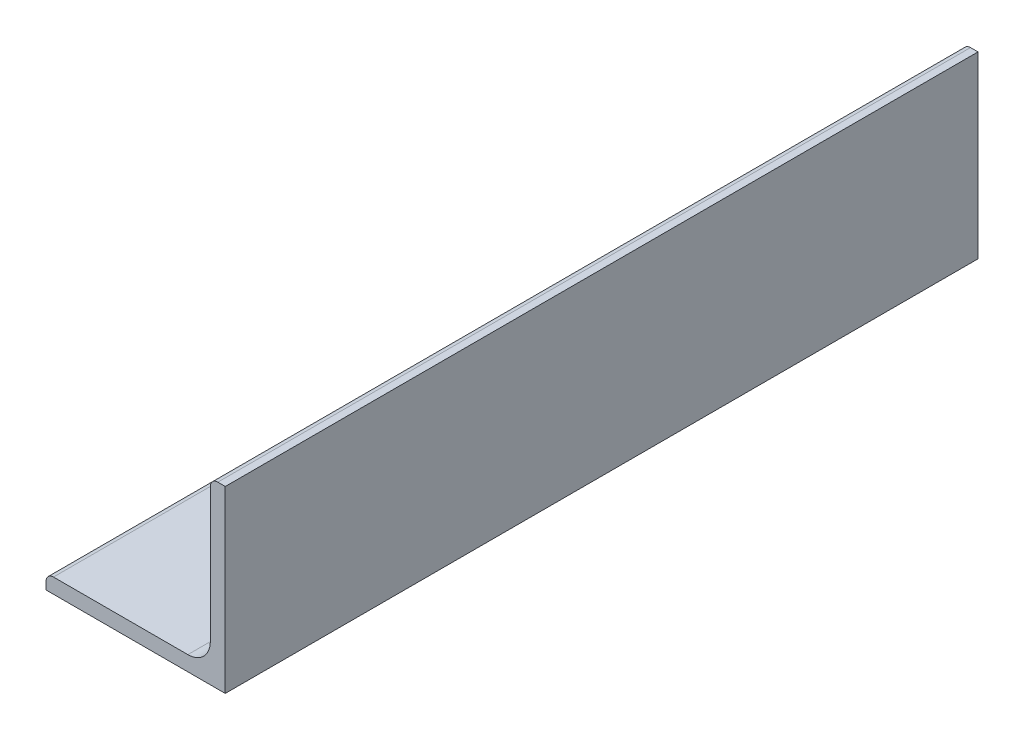
ISO-10303-21;
HEADER;
FILE_DESCRIPTION(('STEP AP214'),'2;1');
FILE_NAME('part.step','',(''),(''),'','','');
FILE_SCHEMA(('AUTOMOTIVE_DESIGN { 1 0 10303 214 1 1 1 1 }'));
ENDSEC;
DATA;
#1=APPLICATION_CONTEXT('core data for automotive mechanical design processes');
#2=APPLICATION_PROTOCOL_DEFINITION('international standard','automotive_design',2000,#1);
#3=PRODUCT_CONTEXT('',#1,'mechanical');
#4=PRODUCT('Part','Part','',(#3));
#5=PRODUCT_RELATED_PRODUCT_CATEGORY('part','',(#4));
#6=PRODUCT_DEFINITION_FORMATION('','',#4);
#7=PRODUCT_DEFINITION_CONTEXT('part definition',#1,'design');
#8=PRODUCT_DEFINITION('design','',#6,#7);
#9=PRODUCT_DEFINITION_SHAPE('','',#8);
#10=(LENGTH_UNIT() NAMED_UNIT(*) SI_UNIT(.MILLI.,.METRE.));
#11=(NAMED_UNIT(*) PLANE_ANGLE_UNIT() SI_UNIT($,.RADIAN.));
#12=(NAMED_UNIT(*) SI_UNIT($,.STERADIAN.) SOLID_ANGLE_UNIT());
#13=UNCERTAINTY_MEASURE_WITH_UNIT(LENGTH_MEASURE(1.E-05),#10,'distance_accuracy_value','');
#14=(GEOMETRIC_REPRESENTATION_CONTEXT(3) GLOBAL_UNCERTAINTY_ASSIGNED_CONTEXT((#13)) GLOBAL_UNIT_ASSIGNED_CONTEXT((#10,
#11,#12)) REPRESENTATION_CONTEXT('',''));
#15=CARTESIAN_POINT('',(0.,0.,0.));
#16=DIRECTION('',(0.,0.,1.));
#17=DIRECTION('',(1.,0.,0.));
#18=AXIS2_PLACEMENT_3D('',#15,#16,#17);
#19=CARTESIAN_POINT('',(-19.05,-17.4625,609.6));
#20=DIRECTION('',(1.,0.,0.));
#21=DIRECTION('',(0.,0.,-1.));
#22=AXIS2_PLACEMENT_3D('',#19,#20,#21);
#23=PLANE('',#22);
#24=DIRECTION('',(0.,0.,-1.));
#25=VECTOR('',#24,1.);
#26=CARTESIAN_POINT('',(-19.05,-17.4625,609.6));
#27=LINE('',#26,#25);
#28=CARTESIAN_POINT('',(-19.05,-17.4625,609.6));
#29=VERTEX_POINT('',#28);
#30=CARTESIAN_POINT('',(-19.05,-17.4625,449.6));
#31=VERTEX_POINT('',#30);
#32=EDGE_CURVE('E152',#29,#31,#27,.T.);
#33=ORIENTED_EDGE('',*,*,#32,.T.);
#34=DIRECTION('',(0.,-1.,0.));
#35=VECTOR('',#34,1.);
#36=CARTESIAN_POINT('',(-19.05,-17.4625,449.6));
#37=LINE('',#36,#35);
#38=CARTESIAN_POINT('',(-19.05,-19.05,449.6));
#39=VERTEX_POINT('',#38);
#40=EDGE_CURVE('E57',#31,#39,#37,.T.);
#41=ORIENTED_EDGE('',*,*,#40,.T.);
#42=DIRECTION('',(0.,0.,-1.));
#43=VECTOR('',#42,1.);
#44=CARTESIAN_POINT('',(-19.05,-19.05,609.6));
#45=LINE('',#44,#43);
#46=CARTESIAN_POINT('',(-19.05,-19.05,609.6));
#47=VERTEX_POINT('',#46);
#48=EDGE_CURVE('E50',#47,#39,#45,.T.);
#49=ORIENTED_EDGE('',*,*,#48,.F.);
#50=DIRECTION('',(0.,-1.,0.));
#51=VECTOR('',#50,1.);
#52=CARTESIAN_POINT('',(-19.05,-17.4625,609.6));
#53=LINE('',#52,#51);
#54=EDGE_CURVE('E169',#29,#47,#53,.T.);
#55=ORIENTED_EDGE('',*,*,#54,.F.);
#56=EDGE_LOOP('',(#33,#41,#49,#55));
#57=FACE_BOUND('',#56,.T.);
#58=ADVANCED_FACE('F43',(#57),#23,.F.);
#59=CARTESIAN_POINT('',(-19.05,-19.05,609.6));
#60=DIRECTION('',(0.,1.,0.));
#61=DIRECTION('',(-1.,0.,0.));
#62=AXIS2_PLACEMENT_3D('',#59,#60,#61);
#63=PLANE('',#62);
#64=ORIENTED_EDGE('',*,*,#48,.T.);
#65=DIRECTION('',(1.,0.,0.));
#66=VECTOR('',#65,1.);
#67=CARTESIAN_POINT('',(-40.95,-19.05,449.6));
#68=LINE('',#67,#66);
#69=CARTESIAN_POINT('',(19.05,-19.05,449.6));
#70=VERTEX_POINT('',#69);
#71=EDGE_CURVE('E114',#39,#70,#68,.T.);
#72=ORIENTED_EDGE('',*,*,#71,.T.);
#73=DIRECTION('',(0.,0.,-1.));
#74=VECTOR('',#73,1.);
#75=CARTESIAN_POINT('',(19.05,-19.05,609.6));
#76=LINE('',#75,#74);
#77=CARTESIAN_POINT('',(19.05,-19.05,609.6));
#78=VERTEX_POINT('',#77);
#79=EDGE_CURVE('E126',#78,#70,#76,.T.);
#80=ORIENTED_EDGE('',*,*,#79,.F.);
#81=DIRECTION('',(1.,0.,0.));
#82=VECTOR('',#81,1.);
#83=CARTESIAN_POINT('',(-19.05,-19.05,609.6));
#84=LINE('',#83,#82);
#85=EDGE_CURVE('E167',#47,#78,#84,.T.);
#86=ORIENTED_EDGE('',*,*,#85,.F.);
#87=EDGE_LOOP('',(#64,#72,#80,#86));
#88=FACE_BOUND('',#87,.T.);
#89=ADVANCED_FACE('F125',(#88),#63,.F.);
#90=CARTESIAN_POINT('',(19.05,-19.05,609.6));
#91=DIRECTION('',(-1.,0.,0.));
#92=DIRECTION('',(0.,-1.,0.));
#93=AXIS2_PLACEMENT_3D('',#90,#91,#92);
#94=PLANE('',#93);
#95=ORIENTED_EDGE('',*,*,#79,.T.);
#96=DIRECTION('',(0.,-1.,0.));
#97=VECTOR('',#96,1.);
#98=CARTESIAN_POINT('',(19.05,19.0499999999999,449.6));
#99=LINE('',#98,#97);
#100=CARTESIAN_POINT('',(19.05,19.0499999999999,449.6));
#101=VERTEX_POINT('',#100);
#102=EDGE_CURVE('E111',#101,#70,#99,.T.);
#103=ORIENTED_EDGE('',*,*,#102,.F.);
#104=DIRECTION('',(0.,0.,-1.));
#105=VECTOR('',#104,1.);
#106=CARTESIAN_POINT('',(19.05,19.05,609.6));
#107=LINE('',#106,#105);
#108=CARTESIAN_POINT('',(19.05,19.05,609.6));
#109=VERTEX_POINT('',#108);
#110=EDGE_CURVE('E133',#109,#101,#107,.T.);
#111=ORIENTED_EDGE('',*,*,#110,.F.);
#112=DIRECTION('',(0.,1.,0.));
#113=VECTOR('',#112,1.);
#114=CARTESIAN_POINT('',(19.05,-19.05,609.6));
#115=LINE('',#114,#113);
#116=EDGE_CURVE('E132',#78,#109,#115,.T.);
#117=ORIENTED_EDGE('',*,*,#116,.F.);
#118=EDGE_LOOP('',(#95,#103,#111,#117));
#119=FACE_BOUND('',#118,.T.);
#120=ADVANCED_FACE('F131',(#119),#94,.F.);
#121=CARTESIAN_POINT('',(17.4625,19.05,609.6));
#122=DIRECTION('',(0.,-1.,0.));
#123=DIRECTION('',(1.,0.,0.));
#124=AXIS2_PLACEMENT_3D('',#121,#122,#123);
#125=PLANE('',#124);
#126=ORIENTED_EDGE('',*,*,#110,.T.);
#127=DIRECTION('',(1.,0.,0.));
#128=VECTOR('',#127,1.);
#129=CARTESIAN_POINT('',(-40.95,19.0499999999999,449.6));
#130=LINE('',#129,#128);
#131=CARTESIAN_POINT('',(17.4625,19.0499999999999,449.6));
#132=VERTEX_POINT('',#131);
#133=EDGE_CURVE('E116',#132,#101,#130,.T.);
#134=ORIENTED_EDGE('',*,*,#133,.F.);
#135=DIRECTION('',(0.,0.,-1.));
#136=VECTOR('',#135,1.);
#137=CARTESIAN_POINT('',(17.4625,19.05,609.6));
#138=LINE('',#137,#136);
#139=CARTESIAN_POINT('',(17.4625,19.05,609.6));
#140=VERTEX_POINT('',#139);
#141=EDGE_CURVE('E135',#140,#132,#138,.T.);
#142=ORIENTED_EDGE('',*,*,#141,.F.);
#143=DIRECTION('',(-1.,0.,0.));
#144=VECTOR('',#143,1.);
#145=CARTESIAN_POINT('',(17.4625,19.05,609.6));
#146=LINE('',#145,#144);
#147=EDGE_CURVE('E164',#109,#140,#146,.T.);
#148=ORIENTED_EDGE('',*,*,#147,.F.);
#149=EDGE_LOOP('',(#126,#134,#142,#148));
#150=FACE_BOUND('',#149,.T.);
#151=ADVANCED_FACE('F196',(#150),#125,.F.);
#152=CARTESIAN_POINT('',(17.4625,17.4625,609.6));
#153=DIRECTION('',(0.,0.,-1.));
#154=DIRECTION('',(-1.,0.,0.));
#155=AXIS2_PLACEMENT_3D('',#152,#153,#154);
#156=CYLINDRICAL_SURFACE('',#155,1.5875);
#157=ORIENTED_EDGE('',*,*,#141,.T.);
#158=CARTESIAN_POINT('',(17.4625,17.4625,449.6));
#159=DIRECTION('',(0.,0.,1.));
#160=DIRECTION('',(1.,0.,0.));
#161=AXIS2_PLACEMENT_3D('',#158,#159,#160);
#162=CIRCLE('',#161,1.5875);
#163=CARTESIAN_POINT('',(15.875,17.4625,449.6));
#164=VERTEX_POINT('',#163);
#165=EDGE_CURVE('E172',#132,#164,#162,.T.);
#166=ORIENTED_EDGE('',*,*,#165,.T.);
#167=DIRECTION('',(0.,0.,-1.));
#168=VECTOR('',#167,1.);
#169=CARTESIAN_POINT('',(15.875,17.4625,609.6));
#170=LINE('',#169,#168);
#171=CARTESIAN_POINT('',(15.875,17.4625,609.6));
#172=VERTEX_POINT('',#171);
#173=EDGE_CURVE('E140',#172,#164,#170,.T.);
#174=ORIENTED_EDGE('',*,*,#173,.F.);
#175=CARTESIAN_POINT('',(17.4625,17.4625,609.6));
#176=DIRECTION('',(0.,0.,1.));
#177=DIRECTION('',(-1.,0.,0.));
#178=AXIS2_PLACEMENT_3D('',#175,#176,#177);
#179=CIRCLE('',#178,1.5875);
#180=EDGE_CURVE('E162',#140,#172,#179,.T.);
#181=ORIENTED_EDGE('',*,*,#180,.F.);
#182=EDGE_LOOP('',(#157,#166,#174,#181));
#183=FACE_BOUND('',#182,.T.);
#184=ADVANCED_FACE('F200',(#183),#156,.T.);
#185=CARTESIAN_POINT('',(15.875,17.4625,609.6));
#186=DIRECTION('',(1.,0.,0.));
#187=DIRECTION('',(0.,1.,0.));
#188=AXIS2_PLACEMENT_3D('',#185,#186,#187);
#189=PLANE('',#188);
#190=ORIENTED_EDGE('',*,*,#173,.T.);
#191=DIRECTION('',(0.,-1.,0.));
#192=VECTOR('',#191,1.);
#193=CARTESIAN_POINT('',(15.875,17.4625,449.6));
#194=LINE('',#193,#192);
#195=CARTESIAN_POINT('',(15.875,-11.0998,449.6));
#196=VERTEX_POINT('',#195);
#197=EDGE_CURVE('E175',#164,#196,#194,.T.);
#198=ORIENTED_EDGE('',*,*,#197,.T.);
#199=DIRECTION('',(0.,0.,-1.));
#200=VECTOR('',#199,1.);
#201=CARTESIAN_POINT('',(15.875,-11.0998,609.6));
#202=LINE('',#201,#200);
#203=CARTESIAN_POINT('',(15.875,-11.0998,609.6));
#204=VERTEX_POINT('',#203);
#205=EDGE_CURVE('E143',#204,#196,#202,.T.);
#206=ORIENTED_EDGE('',*,*,#205,.F.);
#207=DIRECTION('',(0.,-1.,0.));
#208=VECTOR('',#207,1.);
#209=CARTESIAN_POINT('',(15.875,17.4625,609.6));
#210=LINE('',#209,#208);
#211=EDGE_CURVE('E160',#172,#204,#210,.T.);
#212=ORIENTED_EDGE('',*,*,#211,.F.);
#213=EDGE_LOOP('',(#190,#198,#206,#212));
#214=FACE_BOUND('',#213,.T.);
#215=ADVANCED_FACE('F205',(#214),#189,.F.);
#216=CARTESIAN_POINT('',(11.0998,-11.0998,609.6));
#217=DIRECTION('',(0.,0.,-1.));
#218=DIRECTION('',(-1.,0.,0.));
#219=AXIS2_PLACEMENT_3D('',#216,#217,#218);
#220=CYLINDRICAL_SURFACE('',#219,4.7752);
#221=ORIENTED_EDGE('',*,*,#205,.T.);
#222=CARTESIAN_POINT('',(11.0998,-11.0998,449.6));
#223=DIRECTION('',(0.,0.,1.));
#224=DIRECTION('',(1.,0.,0.));
#225=AXIS2_PLACEMENT_3D('',#222,#223,#224);
#226=CIRCLE('',#225,4.7752);
#227=CARTESIAN_POINT('',(11.0998,-15.875,449.6));
#228=VERTEX_POINT('',#227);
#229=EDGE_CURVE('E178',#196,#228,#226,.F.);
#230=ORIENTED_EDGE('',*,*,#229,.T.);
#231=DIRECTION('',(0.,0.,-1.));
#232=VECTOR('',#231,1.);
#233=CARTESIAN_POINT('',(11.0998,-15.875,609.6));
#234=LINE('',#233,#232);
#235=CARTESIAN_POINT('',(11.0998,-15.875,609.6));
#236=VERTEX_POINT('',#235);
#237=EDGE_CURVE('E146',#236,#228,#234,.T.);
#238=ORIENTED_EDGE('',*,*,#237,.F.);
#239=CARTESIAN_POINT('',(11.0998,-11.0998,609.6));
#240=DIRECTION('',(0.,0.,-1.));
#241=DIRECTION('',(-1.,0.,0.));
#242=AXIS2_PLACEMENT_3D('',#239,#240,#241);
#243=CIRCLE('',#242,4.7752);
#244=EDGE_CURVE('E158',#204,#236,#243,.T.);
#245=ORIENTED_EDGE('',*,*,#244,.F.);
#246=EDGE_LOOP('',(#221,#230,#238,#245));
#247=FACE_BOUND('',#246,.T.);
#248=ADVANCED_FACE('F207',(#247),#220,.F.);
#249=CARTESIAN_POINT('',(11.0998,-15.875,609.6));
#250=DIRECTION('',(0.,-1.,0.));
#251=DIRECTION('',(1.,0.,0.));
#252=AXIS2_PLACEMENT_3D('',#249,#250,#251);
#253=PLANE('',#252);
#254=ORIENTED_EDGE('',*,*,#237,.T.);
#255=DIRECTION('',(-1.,0.,0.));
#256=VECTOR('',#255,1.);
#257=CARTESIAN_POINT('',(11.0998,-15.875,449.6));
#258=LINE('',#257,#256);
#259=CARTESIAN_POINT('',(-17.4625,-15.875,449.6));
#260=VERTEX_POINT('',#259);
#261=EDGE_CURVE('E129',#228,#260,#258,.T.);
#262=ORIENTED_EDGE('',*,*,#261,.T.);
#263=DIRECTION('',(0.,0.,-1.));
#264=VECTOR('',#263,1.);
#265=CARTESIAN_POINT('',(-17.4625,-15.875,609.6));
#266=LINE('',#265,#264);
#267=CARTESIAN_POINT('',(-17.4625,-15.875,609.6));
#268=VERTEX_POINT('',#267);
#269=EDGE_CURVE('E149',#268,#260,#266,.T.);
#270=ORIENTED_EDGE('',*,*,#269,.F.);
#271=DIRECTION('',(-1.,0.,0.));
#272=VECTOR('',#271,1.);
#273=CARTESIAN_POINT('',(11.0998,-15.875,609.6));
#274=LINE('',#273,#272);
#275=EDGE_CURVE('E156',#236,#268,#274,.T.);
#276=ORIENTED_EDGE('',*,*,#275,.F.);
#277=EDGE_LOOP('',(#254,#262,#270,#276));
#278=FACE_BOUND('',#277,.T.);
#279=ADVANCED_FACE('F185',(#278),#253,.F.);
#280=CARTESIAN_POINT('',(-17.4625,-17.4625,609.6));
#281=DIRECTION('',(0.,0.,-1.));
#282=DIRECTION('',(-1.,0.,0.));
#283=AXIS2_PLACEMENT_3D('',#280,#281,#282);
#284=CYLINDRICAL_SURFACE('',#283,1.5875);
#285=ORIENTED_EDGE('',*,*,#269,.T.);
#286=CARTESIAN_POINT('',(-17.4625,-17.4625,449.6));
#287=DIRECTION('',(0.,0.,1.));
#288=DIRECTION('',(1.,0.,0.));
#289=AXIS2_PLACEMENT_3D('',#286,#287,#288);
#290=CIRCLE('',#289,1.5875);
#291=EDGE_CURVE('E11',#260,#31,#290,.T.);
#292=ORIENTED_EDGE('',*,*,#291,.T.);
#293=ORIENTED_EDGE('',*,*,#32,.F.);
#294=CARTESIAN_POINT('',(-17.4625,-17.4625,609.6));
#295=DIRECTION('',(0.,0.,1.));
#296=DIRECTION('',(-1.,0.,0.));
#297=AXIS2_PLACEMENT_3D('',#294,#295,#296);
#298=CIRCLE('',#297,1.5875);
#299=EDGE_CURVE('E64',#268,#29,#298,.T.);
#300=ORIENTED_EDGE('',*,*,#299,.F.);
#301=EDGE_LOOP('',(#285,#292,#293,#300));
#302=FACE_BOUND('',#301,.T.);
#303=ADVANCED_FACE('F189',(#302),#284,.T.);
#304=CARTESIAN_POINT('',(17.4625,17.4625,609.6));
#305=DIRECTION('',(0.,0.,-1.));
#306=DIRECTION('',(-1.,0.,0.));
#307=AXIS2_PLACEMENT_3D('',#304,#305,#306);
#308=PLANE('',#307);
#309=ORIENTED_EDGE('',*,*,#54,.T.);
#310=ORIENTED_EDGE('',*,*,#85,.T.);
#311=ORIENTED_EDGE('',*,*,#116,.T.);
#312=ORIENTED_EDGE('',*,*,#147,.T.);
#313=ORIENTED_EDGE('',*,*,#180,.T.);
#314=ORIENTED_EDGE('',*,*,#211,.T.);
#315=ORIENTED_EDGE('',*,*,#244,.T.);
#316=ORIENTED_EDGE('',*,*,#275,.T.);
#317=ORIENTED_EDGE('',*,*,#299,.T.);
#318=EDGE_LOOP('',(#309,#310,#311,#312,#313,#314,#315,#316,#317));
#319=FACE_BOUND('',#318,.T.);
#320=ADVANCED_FACE('F192',(#319),#308,.F.);
#321=CARTESIAN_POINT('',(-40.95,19.0499999999999,449.6));
#322=DIRECTION('',(0.,0.,1.));
#323=DIRECTION('',(1.,0.,0.));
#324=AXIS2_PLACEMENT_3D('',#321,#322,#323);
#325=PLANE('',#324);
#326=ORIENTED_EDGE('',*,*,#291,.F.);
#327=ORIENTED_EDGE('',*,*,#261,.F.);
#328=ORIENTED_EDGE('',*,*,#229,.F.);
#329=ORIENTED_EDGE('',*,*,#197,.F.);
#330=ORIENTED_EDGE('',*,*,#165,.F.);
#331=ORIENTED_EDGE('',*,*,#133,.T.);
#332=ORIENTED_EDGE('',*,*,#102,.T.);
#333=ORIENTED_EDGE('',*,*,#71,.F.);
#334=ORIENTED_EDGE('',*,*,#40,.F.);
#335=EDGE_LOOP('',(#326,#327,#328,#329,#330,#331,#332,#333,#334));
#336=FACE_BOUND('',#335,.T.);
#337=ADVANCED_FACE('F113',(#336),#325,.F.);
#338=CLOSED_SHELL('',(#58,#89,#120,#151,#184,#215,#248,#279,#303,#320,#337));
#339=MANIFOLD_SOLID_BREP('B2',#338);
#340=ADVANCED_BREP_SHAPE_REPRESENTATION('',(#18,#339),#14);
#341=SHAPE_DEFINITION_REPRESENTATION(#9,#340);
ENDSEC;
END-ISO-10303-21;
